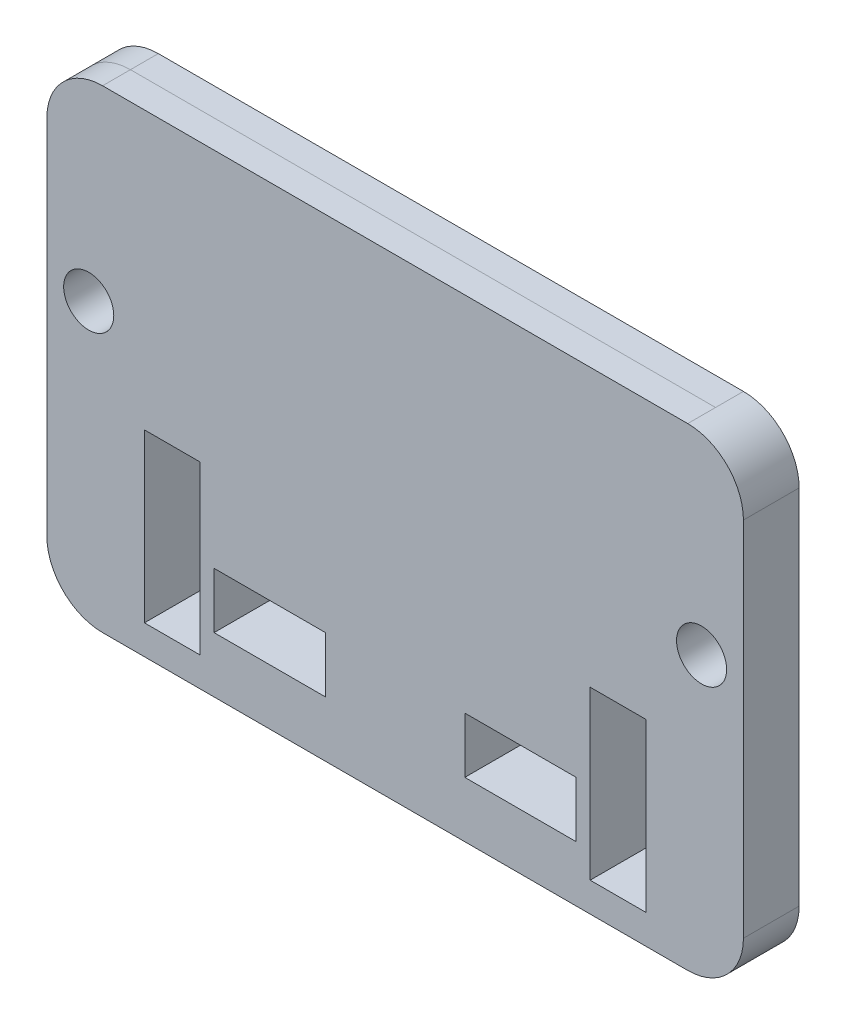
ISO-10303-21;
HEADER;
FILE_DESCRIPTION(('STEP AP214'),'2;1');
FILE_NAME('part.step','',(''),(''),'','','');
FILE_SCHEMA(('AUTOMOTIVE_DESIGN { 1 0 10303 214 1 1 1 1 }'));
ENDSEC;
DATA;
#1=APPLICATION_CONTEXT('core data for automotive mechanical design processes');
#2=APPLICATION_PROTOCOL_DEFINITION('international standard','automotive_design',2000,#1);
#3=PRODUCT_CONTEXT('',#1,'mechanical');
#4=PRODUCT('Part','Part','',(#3));
#5=PRODUCT_RELATED_PRODUCT_CATEGORY('part','',(#4));
#6=PRODUCT_DEFINITION_FORMATION('','',#4);
#7=PRODUCT_DEFINITION_CONTEXT('part definition',#1,'design');
#8=PRODUCT_DEFINITION('design','',#6,#7);
#9=PRODUCT_DEFINITION_SHAPE('','',#8);
#10=(LENGTH_UNIT() NAMED_UNIT(*) SI_UNIT(.MILLI.,.METRE.));
#11=(NAMED_UNIT(*) PLANE_ANGLE_UNIT() SI_UNIT($,.RADIAN.));
#12=(NAMED_UNIT(*) SI_UNIT($,.STERADIAN.) SOLID_ANGLE_UNIT());
#13=UNCERTAINTY_MEASURE_WITH_UNIT(LENGTH_MEASURE(1.E-05),#10,'distance_accuracy_value','');
#14=(GEOMETRIC_REPRESENTATION_CONTEXT(3) GLOBAL_UNCERTAINTY_ASSIGNED_CONTEXT((#13)) GLOBAL_UNIT_ASSIGNED_CONTEXT((#10,
#11,#12)) REPRESENTATION_CONTEXT('',''));
#15=CARTESIAN_POINT('',(0.,0.,0.));
#16=DIRECTION('',(0.,0.,1.));
#17=DIRECTION('',(1.,0.,0.));
#18=AXIS2_PLACEMENT_3D('',#15,#16,#17);
#19=CARTESIAN_POINT('',(-133.373251541,-107.95,25.4));
#20=DIRECTION('',(0.,1.,0.));
#21=DIRECTION('',(-1.,0.,0.));
#22=AXIS2_PLACEMENT_3D('',#19,#20,#21);
#23=PLANE('',#22);
#24=DIRECTION('',(0.,0.,-1.));
#25=VECTOR('',#24,1.);
#26=CARTESIAN_POINT('',(-133.373251541,-107.95,25.4));
#27=LINE('',#26,#25);
#28=CARTESIAN_POINT('',(-133.373251541,-107.95,25.4));
#29=VERTEX_POINT('',#28);
#30=CARTESIAN_POINT('',(-133.373251541,-107.95,12.7));
#31=VERTEX_POINT('',#30);
#32=EDGE_CURVE('E429',#29,#31,#27,.T.);
#33=ORIENTED_EDGE('',*,*,#32,.T.);
#34=DIRECTION('',(1.,0.,0.));
#35=VECTOR('',#34,1.);
#36=CARTESIAN_POINT('',(-133.373251541,-107.95,12.7));
#37=LINE('',#36,#35);
#38=CARTESIAN_POINT('',(133.373251541,-107.95,12.7));
#39=VERTEX_POINT('',#38);
#40=EDGE_CURVE('E12',#31,#39,#37,.T.);
#41=ORIENTED_EDGE('',*,*,#40,.T.);
#42=DIRECTION('',(0.,0.,-1.));
#43=VECTOR('',#42,1.);
#44=CARTESIAN_POINT('',(133.373251541,-107.95,25.4));
#45=LINE('',#44,#43);
#46=CARTESIAN_POINT('',(133.373251541,-107.95,25.4));
#47=VERTEX_POINT('',#46);
#48=EDGE_CURVE('E425',#47,#39,#45,.T.);
#49=ORIENTED_EDGE('',*,*,#48,.F.);
#50=DIRECTION('',(1.,0.,0.));
#51=VECTOR('',#50,1.);
#52=CARTESIAN_POINT('',(-133.373251541,-107.95,25.4));
#53=LINE('',#52,#51);
#54=EDGE_CURVE('E367',#29,#47,#53,.T.);
#55=ORIENTED_EDGE('',*,*,#54,.F.);
#56=EDGE_LOOP('',(#33,#41,#49,#55));
#57=FACE_BOUND('',#56,.T.);
#58=ADVANCED_FACE('F39',(#57),#23,.F.);
#59=CARTESIAN_POINT('',(-133.373251541,-82.55,25.4));
#60=DIRECTION('',(0.,0.,-1.));
#61=DIRECTION('',(-1.,0.,0.));
#62=AXIS2_PLACEMENT_3D('',#59,#60,#61);
#63=CYLINDRICAL_SURFACE('',#62,25.4);
#64=DIRECTION('',(0.,0.,-1.));
#65=VECTOR('',#64,1.);
#66=CARTESIAN_POINT('',(-158.773251541,-82.55,25.4));
#67=LINE('',#66,#65);
#68=CARTESIAN_POINT('',(-158.773251541,-82.55,25.4));
#69=VERTEX_POINT('',#68);
#70=CARTESIAN_POINT('',(-158.773251541,-82.55,12.7));
#71=VERTEX_POINT('',#70);
#72=EDGE_CURVE('E403',#69,#71,#67,.T.);
#73=ORIENTED_EDGE('',*,*,#72,.T.);
#74=CARTESIAN_POINT('',(-133.373251541,-82.55,12.7));
#75=DIRECTION('',(0.,0.,1.));
#76=DIRECTION('',(1.,0.,0.));
#77=AXIS2_PLACEMENT_3D('',#74,#75,#76);
#78=CIRCLE('',#77,25.4);
#79=EDGE_CURVE('E47',#71,#31,#78,.T.);
#80=ORIENTED_EDGE('',*,*,#79,.T.);
#81=ORIENTED_EDGE('',*,*,#32,.F.);
#82=CARTESIAN_POINT('',(-133.373251541,-82.55,25.4));
#83=DIRECTION('',(0.,0.,1.));
#84=DIRECTION('',(-1.,0.,0.));
#85=AXIS2_PLACEMENT_3D('',#82,#83,#84);
#86=CIRCLE('',#85,25.4);
#87=EDGE_CURVE('E364',#69,#29,#86,.T.);
#88=ORIENTED_EDGE('',*,*,#87,.F.);
#89=EDGE_LOOP('',(#73,#80,#81,#88));
#90=FACE_BOUND('',#89,.T.);
#91=ADVANCED_FACE('F443',(#90),#63,.T.);
#92=CARTESIAN_POINT('',(-158.773251541,-82.55,25.4));
#93=DIRECTION('',(1.,0.,0.));
#94=DIRECTION('',(0.,0.,-1.));
#95=AXIS2_PLACEMENT_3D('',#92,#93,#94);
#96=PLANE('',#95);
#97=DIRECTION('',(0.,0.,-1.));
#98=VECTOR('',#97,1.);
#99=CARTESIAN_POINT('',(-158.773251541,82.5499999999999,25.4));
#100=LINE('',#99,#98);
#101=CARTESIAN_POINT('',(-158.773251541,82.5499999999999,25.4));
#102=VERTEX_POINT('',#101);
#103=CARTESIAN_POINT('',(-158.773251541,82.5499999999999,12.7));
#104=VERTEX_POINT('',#103);
#105=EDGE_CURVE('E407',#102,#104,#100,.T.);
#106=ORIENTED_EDGE('',*,*,#105,.T.);
#107=DIRECTION('',(0.,-1.,0.));
#108=VECTOR('',#107,1.);
#109=CARTESIAN_POINT('',(-158.773251541,-82.55,12.7));
#110=LINE('',#109,#108);
#111=EDGE_CURVE('E437',#104,#71,#110,.T.);
#112=ORIENTED_EDGE('',*,*,#111,.T.);
#113=ORIENTED_EDGE('',*,*,#72,.F.);
#114=DIRECTION('',(0.,-1.,0.));
#115=VECTOR('',#114,1.);
#116=CARTESIAN_POINT('',(-158.773251541,-82.55,25.4));
#117=LINE('',#116,#115);
#118=EDGE_CURVE('E380',#102,#69,#117,.T.);
#119=ORIENTED_EDGE('',*,*,#118,.F.);
#120=EDGE_LOOP('',(#106,#112,#113,#119));
#121=FACE_BOUND('',#120,.T.);
#122=ADVANCED_FACE('F460',(#121),#96,.F.);
#123=CARTESIAN_POINT('',(-133.373251541,107.95,25.4));
#124=DIRECTION('',(0.,-1.,0.));
#125=DIRECTION('',(1.,0.,0.));
#126=AXIS2_PLACEMENT_3D('',#123,#124,#125);
#127=PLANE('',#126);
#128=DIRECTION('',(0.,0.,-1.));
#129=VECTOR('',#128,1.);
#130=CARTESIAN_POINT('',(133.373251541,107.95,25.4));
#131=LINE('',#130,#129);
#132=CARTESIAN_POINT('',(133.373251541,107.95,25.4));
#133=VERTEX_POINT('',#132);
#134=CARTESIAN_POINT('',(133.373251541,107.95,12.7));
#135=VERTEX_POINT('',#134);
#136=EDGE_CURVE('E415',#133,#135,#131,.T.);
#137=ORIENTED_EDGE('',*,*,#136,.T.);
#138=DIRECTION('',(-1.,0.,0.));
#139=VECTOR('',#138,1.);
#140=CARTESIAN_POINT('',(-133.373251541,107.95,12.7));
#141=LINE('',#140,#139);
#142=CARTESIAN_POINT('',(-133.373251541,107.95,12.7));
#143=VERTEX_POINT('',#142);
#144=EDGE_CURVE('E435',#135,#143,#141,.T.);
#145=ORIENTED_EDGE('',*,*,#144,.T.);
#146=DIRECTION('',(0.,0.,-1.));
#147=VECTOR('',#146,1.);
#148=CARTESIAN_POINT('',(-133.373251541,107.95,25.4));
#149=LINE('',#148,#147);
#150=CARTESIAN_POINT('',(-133.373251541,107.95,25.4));
#151=VERTEX_POINT('',#150);
#152=EDGE_CURVE('E411',#151,#143,#149,.T.);
#153=ORIENTED_EDGE('',*,*,#152,.F.);
#154=DIRECTION('',(-1.,0.,0.));
#155=VECTOR('',#154,1.);
#156=CARTESIAN_POINT('',(-133.373251541,107.95,25.4));
#157=LINE('',#156,#155);
#158=EDGE_CURVE('E376',#133,#151,#157,.T.);
#159=ORIENTED_EDGE('',*,*,#158,.F.);
#160=EDGE_LOOP('',(#137,#145,#153,#159));
#161=FACE_BOUND('',#160,.T.);
#162=ADVANCED_FACE('F489',(#161),#127,.F.);
#163=CARTESIAN_POINT('',(-133.373251541,82.5499999999999,25.4));
#164=DIRECTION('',(0.,0.,-1.));
#165=DIRECTION('',(-1.,0.,0.));
#166=AXIS2_PLACEMENT_3D('',#163,#164,#165);
#167=CYLINDRICAL_SURFACE('',#166,25.4);
#168=ORIENTED_EDGE('',*,*,#152,.T.);
#169=CARTESIAN_POINT('',(-133.373251541,82.5499999999999,12.7));
#170=DIRECTION('',(0.,0.,1.));
#171=DIRECTION('',(1.,0.,0.));
#172=AXIS2_PLACEMENT_3D('',#169,#170,#171);
#173=CIRCLE('',#172,25.4);
#174=EDGE_CURVE('E432',#143,#104,#173,.T.);
#175=ORIENTED_EDGE('',*,*,#174,.T.);
#176=ORIENTED_EDGE('',*,*,#105,.F.);
#177=CARTESIAN_POINT('',(-133.373251541,82.5499999999999,25.4));
#178=DIRECTION('',(0.,0.,1.));
#179=DIRECTION('',(-1.,0.,0.));
#180=AXIS2_PLACEMENT_3D('',#177,#178,#179);
#181=CIRCLE('',#180,25.4);
#182=EDGE_CURVE('E378',#151,#102,#181,.T.);
#183=ORIENTED_EDGE('',*,*,#182,.F.);
#184=EDGE_LOOP('',(#168,#175,#176,#183));
#185=FACE_BOUND('',#184,.T.);
#186=ADVANCED_FACE('F492',(#185),#167,.T.);
#187=CARTESIAN_POINT('',(-133.373251541,-82.55,25.4));
#188=DIRECTION('',(0.,0.,-1.));
#189=DIRECTION('',(-1.,0.,0.));
#190=AXIS2_PLACEMENT_3D('',#187,#188,#189);
#191=PLANE('',#190);
#192=DIRECTION('',(0.,-1.,0.));
#193=VECTOR('',#192,1.);
#194=CARTESIAN_POINT('',(-88.9,-94.5600768180002,25.4));
#195=LINE('',#194,#193);
#196=CARTESIAN_POINT('',(-88.9,-18.3600768180002,25.4));
#197=VERTEX_POINT('',#196);
#198=CARTESIAN_POINT('',(-88.9,-94.5600768180002,25.4));
#199=VERTEX_POINT('',#198);
#200=EDGE_CURVE('E229',#197,#199,#195,.T.);
#201=ORIENTED_EDGE('',*,*,#200,.T.);
#202=DIRECTION('',(-1.,0.,0.));
#203=VECTOR('',#202,1.);
#204=CARTESIAN_POINT('',(-114.3,-94.5600768180002,25.4));
#205=LINE('',#204,#203);
#206=CARTESIAN_POINT('',(-114.3,-94.5600768180002,25.4));
#207=VERTEX_POINT('',#206);
#208=EDGE_CURVE('E221',#199,#207,#205,.T.);
#209=ORIENTED_EDGE('',*,*,#208,.T.);
#210=DIRECTION('',(0.,1.,0.));
#211=VECTOR('',#210,1.);
#212=CARTESIAN_POINT('',(-114.3,-18.3600768180002,25.4));
#213=LINE('',#212,#211);
#214=CARTESIAN_POINT('',(-114.3,-18.3600768180002,25.4));
#215=VERTEX_POINT('',#214);
#216=EDGE_CURVE('E232',#207,#215,#213,.T.);
#217=ORIENTED_EDGE('',*,*,#216,.T.);
#218=DIRECTION('',(1.,0.,0.));
#219=VECTOR('',#218,1.);
#220=CARTESIAN_POINT('',(-88.9,-18.3600768180002,25.4));
#221=LINE('',#220,#219);
#222=EDGE_CURVE('E54',#215,#197,#221,.T.);
#223=ORIENTED_EDGE('',*,*,#222,.T.);
#224=EDGE_LOOP('',(#201,#209,#217,#223));
#225=FACE_BOUND('',#224,.T.);
#226=DIRECTION('',(0.,-1.,0.));
#227=VECTOR('',#226,1.);
#228=CARTESIAN_POINT('',(114.3,-94.5600768180004,25.4));
#229=LINE('',#228,#227);
#230=CARTESIAN_POINT('',(114.3,-18.3600768180004,25.4));
#231=VERTEX_POINT('',#230);
#232=CARTESIAN_POINT('',(114.3,-94.5600768180004,25.4));
#233=VERTEX_POINT('',#232);
#234=EDGE_CURVE('E262',#231,#233,#229,.T.);
#235=ORIENTED_EDGE('',*,*,#234,.T.);
#236=DIRECTION('',(-1.,0.,0.));
#237=VECTOR('',#236,1.);
#238=CARTESIAN_POINT('',(88.9,-94.5600768180004,25.4));
#239=LINE('',#238,#237);
#240=CARTESIAN_POINT('',(88.9,-94.5600768180004,25.4));
#241=VERTEX_POINT('',#240);
#242=EDGE_CURVE('E273',#233,#241,#239,.T.);
#243=ORIENTED_EDGE('',*,*,#242,.T.);
#244=DIRECTION('',(0.,1.,0.));
#245=VECTOR('',#244,1.);
#246=CARTESIAN_POINT('',(88.9,-18.3600768180004,25.4));
#247=LINE('',#246,#245);
#248=CARTESIAN_POINT('',(88.9,-18.3600768180004,25.4));
#249=VERTEX_POINT('',#248);
#250=EDGE_CURVE('E283',#241,#249,#247,.T.);
#251=ORIENTED_EDGE('',*,*,#250,.T.);
#252=DIRECTION('',(1.,0.,0.));
#253=VECTOR('',#252,1.);
#254=CARTESIAN_POINT('',(114.3,-18.3600768180004,25.4));
#255=LINE('',#254,#253);
#256=EDGE_CURVE('E62',#249,#231,#255,.T.);
#257=ORIENTED_EDGE('',*,*,#256,.T.);
#258=EDGE_LOOP('',(#235,#243,#251,#257));
#259=FACE_BOUND('',#258,.T.);
#260=DIRECTION('',(-1.,0.,0.));
#261=VECTOR('',#260,1.);
#262=CARTESIAN_POINT('',(82.55,-82.55,25.4));
#263=LINE('',#262,#261);
#264=CARTESIAN_POINT('',(82.55,-82.55,25.4));
#265=VERTEX_POINT('',#264);
#266=CARTESIAN_POINT('',(31.75,-82.55,25.4));
#267=VERTEX_POINT('',#266);
#268=EDGE_CURVE('E298',#265,#267,#263,.T.);
#269=ORIENTED_EDGE('',*,*,#268,.T.);
#270=DIRECTION('',(0.,1.,0.));
#271=VECTOR('',#270,1.);
#272=CARTESIAN_POINT('',(31.75,-82.55,25.4));
#273=LINE('',#272,#271);
#274=CARTESIAN_POINT('',(31.75,-57.15,25.4));
#275=VERTEX_POINT('',#274);
#276=EDGE_CURVE('E288',#267,#275,#273,.T.);
#277=ORIENTED_EDGE('',*,*,#276,.T.);
#278=DIRECTION('',(1.,0.,0.));
#279=VECTOR('',#278,1.);
#280=CARTESIAN_POINT('',(82.55,-57.15,25.4));
#281=LINE('',#280,#279);
#282=CARTESIAN_POINT('',(82.55,-57.15,25.4));
#283=VERTEX_POINT('',#282);
#284=EDGE_CURVE('E291',#275,#283,#281,.T.);
#285=ORIENTED_EDGE('',*,*,#284,.T.);
#286=DIRECTION('',(0.,-1.,0.));
#287=VECTOR('',#286,1.);
#288=CARTESIAN_POINT('',(82.55,-82.55,25.4));
#289=LINE('',#288,#287);
#290=EDGE_CURVE('E295',#283,#265,#289,.T.);
#291=ORIENTED_EDGE('',*,*,#290,.T.);
#292=EDGE_LOOP('',(#269,#277,#285,#291));
#293=FACE_BOUND('',#292,.T.);
#294=DIRECTION('',(-1.,0.,0.));
#295=VECTOR('',#294,1.);
#296=CARTESIAN_POINT('',(-31.75,-82.55,25.4));
#297=LINE('',#296,#295);
#298=CARTESIAN_POINT('',(-31.75,-82.55,25.4));
#299=VERTEX_POINT('',#298);
#300=CARTESIAN_POINT('',(-82.55,-82.55,25.4));
#301=VERTEX_POINT('',#300);
#302=EDGE_CURVE('E325',#299,#301,#297,.T.);
#303=ORIENTED_EDGE('',*,*,#302,.T.);
#304=DIRECTION('',(0.,1.,0.));
#305=VECTOR('',#304,1.);
#306=CARTESIAN_POINT('',(-82.55,-82.55,25.4));
#307=LINE('',#306,#305);
#308=CARTESIAN_POINT('',(-82.55,-57.15,25.4));
#309=VERTEX_POINT('',#308);
#310=EDGE_CURVE('E335',#301,#309,#307,.T.);
#311=ORIENTED_EDGE('',*,*,#310,.T.);
#312=DIRECTION('',(1.,0.,0.));
#313=VECTOR('',#312,1.);
#314=CARTESIAN_POINT('',(-31.75,-57.15,25.4));
#315=LINE('',#314,#313);
#316=CARTESIAN_POINT('',(-31.75,-57.15,25.4));
#317=VERTEX_POINT('',#316);
#318=EDGE_CURVE('E347',#309,#317,#315,.T.);
#319=ORIENTED_EDGE('',*,*,#318,.T.);
#320=DIRECTION('',(0.,-1.,0.));
#321=VECTOR('',#320,1.);
#322=CARTESIAN_POINT('',(-31.75,-82.55,25.4));
#323=LINE('',#322,#321);
#324=EDGE_CURVE('E344',#317,#299,#323,.T.);
#325=ORIENTED_EDGE('',*,*,#324,.T.);
#326=EDGE_LOOP('',(#303,#311,#319,#325));
#327=FACE_BOUND('',#326,.T.);
#328=ORIENTED_EDGE('',*,*,#87,.T.);
#329=ORIENTED_EDGE('',*,*,#54,.T.);
#330=CARTESIAN_POINT('',(133.373251541,-82.55,25.4));
#331=DIRECTION('',(0.,0.,1.));
#332=DIRECTION('',(1.,0.,0.));
#333=AXIS2_PLACEMENT_3D('',#330,#331,#332);
#334=CIRCLE('',#333,25.4);
#335=CARTESIAN_POINT('',(158.773251541,-82.55,25.4));
#336=VERTEX_POINT('',#335);
#337=EDGE_CURVE('E370',#47,#336,#334,.T.);
#338=ORIENTED_EDGE('',*,*,#337,.T.);
#339=DIRECTION('',(0.,1.,0.));
#340=VECTOR('',#339,1.);
#341=CARTESIAN_POINT('',(158.773251541,-82.55,25.4));
#342=LINE('',#341,#340);
#343=CARTESIAN_POINT('',(158.773251541,82.55,25.4));
#344=VERTEX_POINT('',#343);
#345=EDGE_CURVE('E372',#336,#344,#342,.T.);
#346=ORIENTED_EDGE('',*,*,#345,.T.);
#347=CARTESIAN_POINT('',(133.373251541,82.55,25.4));
#348=DIRECTION('',(0.,0.,1.));
#349=DIRECTION('',(-1.,0.,0.));
#350=AXIS2_PLACEMENT_3D('',#347,#348,#349);
#351=CIRCLE('',#350,25.4);
#352=EDGE_CURVE('E374',#344,#133,#351,.T.);
#353=ORIENTED_EDGE('',*,*,#352,.T.);
#354=ORIENTED_EDGE('',*,*,#158,.T.);
#355=ORIENTED_EDGE('',*,*,#182,.T.);
#356=ORIENTED_EDGE('',*,*,#118,.T.);
#357=EDGE_LOOP('',(#328,#329,#338,#346,#353,#354,#355,#356));
#358=FACE_BOUND('',#357,.T.);
#359=CARTESIAN_POINT('',(-139.7,19.739923182,25.4));
#360=DIRECTION('',(0.,0.,1.));
#361=DIRECTION('',(1.,0.,0.));
#362=AXIS2_PLACEMENT_3D('',#359,#360,#361);
#363=CIRCLE('',#362,11.422);
#364=CARTESIAN_POINT('',(-128.278,19.739923182,25.4));
#365=VERTEX_POINT('',#364);
#366=EDGE_CURVE('E358',#365,#365,#363,.T.);
#367=ORIENTED_EDGE('',*,*,#366,.F.);
#368=EDGE_LOOP('',(#367));
#369=FACE_BOUND('',#368,.T.);
#370=CARTESIAN_POINT('',(139.7,19.739923182,25.4));
#371=DIRECTION('',(0.,0.,1.));
#372=DIRECTION('',(1.,0.,0.));
#373=AXIS2_PLACEMENT_3D('',#370,#371,#372);
#374=CIRCLE('',#373,11.422);
#375=CARTESIAN_POINT('',(151.122,19.739923182,25.4));
#376=VERTEX_POINT('',#375);
#377=EDGE_CURVE('E352',#376,#376,#374,.T.);
#378=ORIENTED_EDGE('',*,*,#377,.F.);
#379=EDGE_LOOP('',(#378));
#380=FACE_BOUND('',#379,.T.);
#381=ADVANCED_FACE('F236',(#225,#259,#293,#327,#358,#369,#380),#191,.F.);
#382=CARTESIAN_POINT('',(-133.373251541,-82.55,0.));
#383=DIRECTION('',(0.,0.,-1.));
#384=DIRECTION('',(-1.,0.,0.));
#385=AXIS2_PLACEMENT_3D('',#382,#383,#384);
#386=PLANE('',#385);
#387=DIRECTION('',(-1.,0.,0.));
#388=VECTOR('',#387,1.);
#389=CARTESIAN_POINT('',(-114.3,-94.5600768180002,0.));
#390=LINE('',#389,#388);
#391=CARTESIAN_POINT('',(-88.9,-94.5600768180002,0.));
#392=VERTEX_POINT('',#391);
#393=CARTESIAN_POINT('',(-114.3,-94.5600768180002,0.));
#394=VERTEX_POINT('',#393);
#395=EDGE_CURVE('E224',#392,#394,#390,.T.);
#396=ORIENTED_EDGE('',*,*,#395,.F.);
#397=DIRECTION('',(0.,-1.,0.));
#398=VECTOR('',#397,1.);
#399=CARTESIAN_POINT('',(-88.9,-94.5600768180002,0.));
#400=LINE('',#399,#398);
#401=CARTESIAN_POINT('',(-88.9,-18.3600768180002,0.));
#402=VERTEX_POINT('',#401);
#403=EDGE_CURVE('E239',#402,#392,#400,.T.);
#404=ORIENTED_EDGE('',*,*,#403,.F.);
#405=DIRECTION('',(1.,0.,0.));
#406=VECTOR('',#405,1.);
#407=CARTESIAN_POINT('',(-88.9,-18.3600768180002,0.));
#408=LINE('',#407,#406);
#409=CARTESIAN_POINT('',(-114.3,-18.3600768180002,0.));
#410=VERTEX_POINT('',#409);
#411=EDGE_CURVE('E242',#410,#402,#408,.T.);
#412=ORIENTED_EDGE('',*,*,#411,.F.);
#413=DIRECTION('',(0.,1.,0.));
#414=VECTOR('',#413,1.);
#415=CARTESIAN_POINT('',(-114.3,-18.3600768180002,0.));
#416=LINE('',#415,#414);
#417=EDGE_CURVE('E248',#394,#410,#416,.T.);
#418=ORIENTED_EDGE('',*,*,#417,.F.);
#419=EDGE_LOOP('',(#396,#404,#412,#418));
#420=FACE_BOUND('',#419,.T.);
#421=DIRECTION('',(-1.,0.,0.));
#422=VECTOR('',#421,1.);
#423=CARTESIAN_POINT('',(88.9,-94.5600768180004,0.));
#424=LINE('',#423,#422);
#425=CARTESIAN_POINT('',(114.3,-94.5600768180004,0.));
#426=VERTEX_POINT('',#425);
#427=CARTESIAN_POINT('',(88.9,-94.5600768180004,0.));
#428=VERTEX_POINT('',#427);
#429=EDGE_CURVE('E249',#426,#428,#424,.T.);
#430=ORIENTED_EDGE('',*,*,#429,.F.);
#431=DIRECTION('',(0.,-1.,0.));
#432=VECTOR('',#431,1.);
#433=CARTESIAN_POINT('',(114.3,-94.5600768180004,0.));
#434=LINE('',#433,#432);
#435=CARTESIAN_POINT('',(114.3,-18.3600768180004,0.));
#436=VERTEX_POINT('',#435);
#437=EDGE_CURVE('E269',#436,#426,#434,.T.);
#438=ORIENTED_EDGE('',*,*,#437,.F.);
#439=DIRECTION('',(1.,0.,0.));
#440=VECTOR('',#439,1.);
#441=CARTESIAN_POINT('',(114.3,-18.3600768180004,0.));
#442=LINE('',#441,#440);
#443=CARTESIAN_POINT('',(88.9,-18.3600768180004,0.));
#444=VERTEX_POINT('',#443);
#445=EDGE_CURVE('E272',#444,#436,#442,.T.);
#446=ORIENTED_EDGE('',*,*,#445,.F.);
#447=DIRECTION('',(0.,1.,0.));
#448=VECTOR('',#447,1.);
#449=CARTESIAN_POINT('',(88.9,-18.3600768180004,0.));
#450=LINE('',#449,#448);
#451=EDGE_CURVE('E276',#428,#444,#450,.T.);
#452=ORIENTED_EDGE('',*,*,#451,.F.);
#453=EDGE_LOOP('',(#430,#438,#446,#452));
#454=FACE_BOUND('',#453,.T.);
#455=DIRECTION('',(0.,1.,0.));
#456=VECTOR('',#455,1.);
#457=CARTESIAN_POINT('',(31.75,-82.55,0.));
#458=LINE('',#457,#456);
#459=CARTESIAN_POINT('',(31.75,-82.55,0.));
#460=VERTEX_POINT('',#459);
#461=CARTESIAN_POINT('',(31.75,-57.15,0.));
#462=VERTEX_POINT('',#461);
#463=EDGE_CURVE('E302',#460,#462,#458,.T.);
#464=ORIENTED_EDGE('',*,*,#463,.F.);
#465=DIRECTION('',(-1.,0.,0.));
#466=VECTOR('',#465,1.);
#467=CARTESIAN_POINT('',(82.55,-82.55,0.));
#468=LINE('',#467,#466);
#469=CARTESIAN_POINT('',(82.55,-82.55,0.));
#470=VERTEX_POINT('',#469);
#471=EDGE_CURVE('E292',#470,#460,#468,.T.);
#472=ORIENTED_EDGE('',*,*,#471,.F.);
#473=DIRECTION('',(0.,-1.,0.));
#474=VECTOR('',#473,1.);
#475=CARTESIAN_POINT('',(82.55,-82.55,0.));
#476=LINE('',#475,#474);
#477=CARTESIAN_POINT('',(82.55,-57.15,0.));
#478=VERTEX_POINT('',#477);
#479=EDGE_CURVE('E308',#478,#470,#476,.T.);
#480=ORIENTED_EDGE('',*,*,#479,.F.);
#481=DIRECTION('',(1.,0.,0.));
#482=VECTOR('',#481,1.);
#483=CARTESIAN_POINT('',(82.55,-57.15,0.));
#484=LINE('',#483,#482);
#485=EDGE_CURVE('E304',#462,#478,#484,.T.);
#486=ORIENTED_EDGE('',*,*,#485,.F.);
#487=EDGE_LOOP('',(#464,#472,#480,#486));
#488=FACE_BOUND('',#487,.T.);
#489=DIRECTION('',(0.,1.,0.));
#490=VECTOR('',#489,1.);
#491=CARTESIAN_POINT('',(-82.55,-82.55,0.));
#492=LINE('',#491,#490);
#493=CARTESIAN_POINT('',(-82.55,-82.55,0.));
#494=VERTEX_POINT('',#493);
#495=CARTESIAN_POINT('',(-82.55,-57.15,0.));
#496=VERTEX_POINT('',#495);
#497=EDGE_CURVE('E305',#494,#496,#492,.T.);
#498=ORIENTED_EDGE('',*,*,#497,.F.);
#499=DIRECTION('',(-1.,0.,0.));
#500=VECTOR('',#499,1.);
#501=CARTESIAN_POINT('',(-31.75,-82.55,0.));
#502=LINE('',#501,#500);
#503=CARTESIAN_POINT('',(-31.75,-82.55,0.));
#504=VERTEX_POINT('',#503);
#505=EDGE_CURVE('E331',#504,#494,#502,.T.);
#506=ORIENTED_EDGE('',*,*,#505,.F.);
#507=DIRECTION('',(0.,-1.,0.));
#508=VECTOR('',#507,1.);
#509=CARTESIAN_POINT('',(-31.75,-82.55,0.));
#510=LINE('',#509,#508);
#511=CARTESIAN_POINT('',(-31.75,-57.15,0.));
#512=VERTEX_POINT('',#511);
#513=EDGE_CURVE('E334',#512,#504,#510,.T.);
#514=ORIENTED_EDGE('',*,*,#513,.F.);
#515=DIRECTION('',(1.,0.,0.));
#516=VECTOR('',#515,1.);
#517=CARTESIAN_POINT('',(-31.75,-57.15,0.));
#518=LINE('',#517,#516);
#519=EDGE_CURVE('E338',#496,#512,#518,.T.);
#520=ORIENTED_EDGE('',*,*,#519,.F.);
#521=EDGE_LOOP('',(#498,#506,#514,#520));
#522=FACE_BOUND('',#521,.T.);
#523=CARTESIAN_POINT('',(-139.7,19.739923182,0.));
#524=DIRECTION('',(0.,0.,1.));
#525=DIRECTION('',(1.,0.,0.));
#526=AXIS2_PLACEMENT_3D('',#523,#524,#525);
#527=CIRCLE('',#526,11.422);
#528=CARTESIAN_POINT('',(-128.278,19.739923182,0.));
#529=VERTEX_POINT('',#528);
#530=EDGE_CURVE('E355',#529,#529,#527,.T.);
#531=ORIENTED_EDGE('',*,*,#530,.T.);
#532=EDGE_LOOP('',(#531));
#533=FACE_BOUND('',#532,.T.);
#534=CARTESIAN_POINT('',(-133.373251541,-82.55,0.));
#535=DIRECTION('',(0.,0.,1.));
#536=DIRECTION('',(-1.,0.,0.));
#537=AXIS2_PLACEMENT_3D('',#534,#535,#536);
#538=CIRCLE('',#537,25.4);
#539=CARTESIAN_POINT('',(-158.773251541,-82.55,0.));
#540=VERTEX_POINT('',#539);
#541=CARTESIAN_POINT('',(-133.373251541,-107.95,0.));
#542=VERTEX_POINT('',#541);
#543=EDGE_CURVE('E361',#540,#542,#538,.T.);
#544=ORIENTED_EDGE('',*,*,#543,.F.);
#545=DIRECTION('',(0.,-1.,0.));
#546=VECTOR('',#545,1.);
#547=CARTESIAN_POINT('',(-158.773251541,-82.55,0.));
#548=LINE('',#547,#546);
#549=CARTESIAN_POINT('',(-158.773251541,82.5499999999999,0.));
#550=VERTEX_POINT('',#549);
#551=EDGE_CURVE('E368',#550,#540,#548,.T.);
#552=ORIENTED_EDGE('',*,*,#551,.F.);
#553=CARTESIAN_POINT('',(-133.373251541,82.5499999999999,0.));
#554=DIRECTION('',(0.,0.,1.));
#555=DIRECTION('',(-1.,0.,0.));
#556=AXIS2_PLACEMENT_3D('',#553,#554,#555);
#557=CIRCLE('',#556,25.4);
#558=CARTESIAN_POINT('',(-133.373251541,107.95,0.));
#559=VERTEX_POINT('',#558);
#560=EDGE_CURVE('E398',#559,#550,#557,.T.);
#561=ORIENTED_EDGE('',*,*,#560,.F.);
#562=DIRECTION('',(-1.,0.,0.));
#563=VECTOR('',#562,1.);
#564=CARTESIAN_POINT('',(-133.373251541,107.95,0.));
#565=LINE('',#564,#563);
#566=CARTESIAN_POINT('',(133.373251541,107.95,0.));
#567=VERTEX_POINT('',#566);
#568=EDGE_CURVE('E395',#567,#559,#565,.T.);
#569=ORIENTED_EDGE('',*,*,#568,.F.);
#570=CARTESIAN_POINT('',(133.373251541,82.55,0.));
#571=DIRECTION('',(0.,0.,1.));
#572=DIRECTION('',(-1.,0.,0.));
#573=AXIS2_PLACEMENT_3D('',#570,#571,#572);
#574=CIRCLE('',#573,25.4);
#575=CARTESIAN_POINT('',(158.773251541,82.55,0.));
#576=VERTEX_POINT('',#575);
#577=EDGE_CURVE('E392',#576,#567,#574,.T.);
#578=ORIENTED_EDGE('',*,*,#577,.F.);
#579=DIRECTION('',(0.,1.,0.));
#580=VECTOR('',#579,1.);
#581=CARTESIAN_POINT('',(158.773251541,-82.55,0.));
#582=LINE('',#581,#580);
#583=CARTESIAN_POINT('',(158.773251541,-82.55,0.));
#584=VERTEX_POINT('',#583);
#585=EDGE_CURVE('E390',#584,#576,#582,.T.);
#586=ORIENTED_EDGE('',*,*,#585,.F.);
#587=CARTESIAN_POINT('',(133.373251541,-82.55,0.));
#588=DIRECTION('',(0.,0.,1.));
#589=DIRECTION('',(1.,0.,0.));
#590=AXIS2_PLACEMENT_3D('',#587,#588,#589);
#591=CIRCLE('',#590,25.4);
#592=CARTESIAN_POINT('',(133.373251541,-107.95,0.));
#593=VERTEX_POINT('',#592);
#594=EDGE_CURVE('E388',#593,#584,#591,.T.);
#595=ORIENTED_EDGE('',*,*,#594,.F.);
#596=DIRECTION('',(1.,0.,0.));
#597=VECTOR('',#596,1.);
#598=CARTESIAN_POINT('',(-133.373251541,-107.95,0.));
#599=LINE('',#598,#597);
#600=EDGE_CURVE('E385',#542,#593,#599,.T.);
#601=ORIENTED_EDGE('',*,*,#600,.F.);
#602=EDGE_LOOP('',(#544,#552,#561,#569,#578,#586,#595,#601));
#603=FACE_BOUND('',#602,.T.);
#604=CARTESIAN_POINT('',(139.7,19.739923182,0.));
#605=DIRECTION('',(0.,0.,1.));
#606=DIRECTION('',(1.,0.,0.));
#607=AXIS2_PLACEMENT_3D('',#604,#605,#606);
#608=CIRCLE('',#607,11.422);
#609=CARTESIAN_POINT('',(151.122,19.739923182,0.));
#610=VERTEX_POINT('',#609);
#611=EDGE_CURVE('E315',#610,#610,#608,.T.);
#612=ORIENTED_EDGE('',*,*,#611,.T.);
#613=EDGE_LOOP('',(#612));
#614=FACE_BOUND('',#613,.T.);
#615=ADVANCED_FACE('F468',(#420,#454,#488,#522,#533,#603,#614),#386,.T.);
#616=ORIENTED_EDGE('',*,*,#79,.F.);
#617=EDGE_CURVE('E382',#71,#540,#67,.T.);
#618=ORIENTED_EDGE('',*,*,#617,.T.);
#619=ORIENTED_EDGE('',*,*,#543,.T.);
#620=EDGE_CURVE('E428',#31,#542,#27,.T.);
#621=ORIENTED_EDGE('',*,*,#620,.F.);
#622=EDGE_LOOP('',(#616,#618,#619,#621));
#623=FACE_BOUND('',#622,.T.);
#624=ADVANCED_FACE('F41',(#623),#63,.T.);
#625=ORIENTED_EDGE('',*,*,#40,.F.);
#626=ORIENTED_EDGE('',*,*,#620,.T.);
#627=ORIENTED_EDGE('',*,*,#600,.T.);
#628=EDGE_CURVE('E424',#39,#593,#45,.T.);
#629=ORIENTED_EDGE('',*,*,#628,.F.);
#630=EDGE_LOOP('',(#625,#626,#627,#629));
#631=FACE_BOUND('',#630,.T.);
#632=ADVANCED_FACE('F472',(#631),#23,.F.);
#633=CARTESIAN_POINT('',(133.373251541,-82.55,25.4));
#634=DIRECTION('',(0.,0.,-1.));
#635=DIRECTION('',(-1.,0.,0.));
#636=AXIS2_PLACEMENT_3D('',#633,#634,#635);
#637=CYLINDRICAL_SURFACE('',#636,25.4);
#638=ORIENTED_EDGE('',*,*,#594,.T.);
#639=DIRECTION('',(0.,0.,-1.));
#640=VECTOR('',#639,1.);
#641=CARTESIAN_POINT('',(158.773251541,-82.55,25.4));
#642=LINE('',#641,#640);
#643=EDGE_CURVE('E421',#336,#584,#642,.T.);
#644=ORIENTED_EDGE('',*,*,#643,.F.);
#645=ORIENTED_EDGE('',*,*,#337,.F.);
#646=ORIENTED_EDGE('',*,*,#48,.T.);
#647=ORIENTED_EDGE('',*,*,#628,.T.);
#648=EDGE_LOOP('',(#638,#644,#645,#646,#647));
#649=FACE_BOUND('',#648,.T.);
#650=ADVANCED_FACE('F474',(#649),#637,.T.);
#651=CARTESIAN_POINT('',(158.773251541,-82.55,25.4));
#652=DIRECTION('',(-1.,0.,0.));
#653=DIRECTION('',(0.,0.,1.));
#654=AXIS2_PLACEMENT_3D('',#651,#652,#653);
#655=PLANE('',#654);
#656=ORIENTED_EDGE('',*,*,#585,.T.);
#657=DIRECTION('',(0.,0.,-1.));
#658=VECTOR('',#657,1.);
#659=CARTESIAN_POINT('',(158.773251541,82.55,25.4));
#660=LINE('',#659,#658);
#661=EDGE_CURVE('E418',#344,#576,#660,.T.);
#662=ORIENTED_EDGE('',*,*,#661,.F.);
#663=ORIENTED_EDGE('',*,*,#345,.F.);
#664=ORIENTED_EDGE('',*,*,#643,.T.);
#665=EDGE_LOOP('',(#656,#662,#663,#664));
#666=FACE_BOUND('',#665,.T.);
#667=ADVANCED_FACE('F481',(#666),#655,.F.);
#668=CARTESIAN_POINT('',(133.373251541,82.55,25.4));
#669=DIRECTION('',(0.,0.,-1.));
#670=DIRECTION('',(-1.,0.,0.));
#671=AXIS2_PLACEMENT_3D('',#668,#669,#670);
#672=CYLINDRICAL_SURFACE('',#671,25.4);
#673=ORIENTED_EDGE('',*,*,#577,.T.);
#674=EDGE_CURVE('E414',#135,#567,#131,.T.);
#675=ORIENTED_EDGE('',*,*,#674,.F.);
#676=ORIENTED_EDGE('',*,*,#136,.F.);
#677=ORIENTED_EDGE('',*,*,#352,.F.);
#678=ORIENTED_EDGE('',*,*,#661,.T.);
#679=EDGE_LOOP('',(#673,#675,#676,#677,#678));
#680=FACE_BOUND('',#679,.T.);
#681=ADVANCED_FACE('F484',(#680),#672,.T.);
#682=ORIENTED_EDGE('',*,*,#144,.F.);
#683=ORIENTED_EDGE('',*,*,#674,.T.);
#684=ORIENTED_EDGE('',*,*,#568,.T.);
#685=EDGE_CURVE('E410',#143,#559,#149,.T.);
#686=ORIENTED_EDGE('',*,*,#685,.F.);
#687=EDGE_LOOP('',(#682,#683,#684,#686));
#688=FACE_BOUND('',#687,.T.);
#689=ADVANCED_FACE('F498',(#688),#127,.F.);
#690=ORIENTED_EDGE('',*,*,#174,.F.);
#691=ORIENTED_EDGE('',*,*,#685,.T.);
#692=ORIENTED_EDGE('',*,*,#560,.T.);
#693=EDGE_CURVE('E406',#104,#550,#100,.T.);
#694=ORIENTED_EDGE('',*,*,#693,.F.);
#695=EDGE_LOOP('',(#690,#691,#692,#694));
#696=FACE_BOUND('',#695,.T.);
#697=ADVANCED_FACE('F495',(#696),#167,.T.);
#698=ORIENTED_EDGE('',*,*,#111,.F.);
#699=ORIENTED_EDGE('',*,*,#693,.T.);
#700=ORIENTED_EDGE('',*,*,#551,.T.);
#701=ORIENTED_EDGE('',*,*,#617,.F.);
#702=EDGE_LOOP('',(#698,#699,#700,#701));
#703=FACE_BOUND('',#702,.T.);
#704=ADVANCED_FACE('F463',(#703),#96,.F.);
#705=CARTESIAN_POINT('',(-139.7,19.739923182,25.4));
#706=DIRECTION('',(0.,0.,-1.));
#707=DIRECTION('',(-1.,0.,0.));
#708=AXIS2_PLACEMENT_3D('',#705,#706,#707);
#709=CYLINDRICAL_SURFACE('',#708,11.422);
#710=ORIENTED_EDGE('',*,*,#366,.T.);
#711=EDGE_LOOP('',(#710));
#712=FACE_BOUND('',#711,.T.);
#713=ORIENTED_EDGE('',*,*,#530,.F.);
#714=EDGE_LOOP('',(#713));
#715=FACE_BOUND('',#714,.T.);
#716=ADVANCED_FACE('F534',(#712,#715),#709,.F.);
#717=CARTESIAN_POINT('',(139.7,19.739923182,25.4));
#718=DIRECTION('',(0.,0.,-1.));
#719=DIRECTION('',(-1.,0.,0.));
#720=AXIS2_PLACEMENT_3D('',#717,#718,#719);
#721=CYLINDRICAL_SURFACE('',#720,11.422);
#722=ORIENTED_EDGE('',*,*,#377,.T.);
#723=EDGE_LOOP('',(#722));
#724=FACE_BOUND('',#723,.T.);
#725=ORIENTED_EDGE('',*,*,#611,.F.);
#726=EDGE_LOOP('',(#725));
#727=FACE_BOUND('',#726,.T.);
#728=ADVANCED_FACE('F538',(#724,#727),#721,.F.);
#729=CARTESIAN_POINT('',(-82.55,-82.55,25.4));
#730=DIRECTION('',(-1.,0.,0.));
#731=DIRECTION('',(0.,0.,1.));
#732=AXIS2_PLACEMENT_3D('',#729,#730,#731);
#733=PLANE('',#732);
#734=ORIENTED_EDGE('',*,*,#497,.T.);
#735=DIRECTION('',(0.,0.,-1.));
#736=VECTOR('',#735,1.);
#737=CARTESIAN_POINT('',(-82.55,-57.15,25.4));
#738=LINE('',#737,#736);
#739=EDGE_CURVE('E322',#309,#496,#738,.T.);
#740=ORIENTED_EDGE('',*,*,#739,.F.);
#741=ORIENTED_EDGE('',*,*,#310,.F.);
#742=DIRECTION('',(0.,0.,-1.));
#743=VECTOR('',#742,1.);
#744=CARTESIAN_POINT('',(-82.55,-82.55,25.4));
#745=LINE('',#744,#743);
#746=EDGE_CURVE('E255',#301,#494,#745,.T.);
#747=ORIENTED_EDGE('',*,*,#746,.T.);
#748=EDGE_LOOP('',(#734,#740,#741,#747));
#749=FACE_BOUND('',#748,.T.);
#750=ADVANCED_FACE('F677',(#749),#733,.F.);
#751=CARTESIAN_POINT('',(-31.75,-82.55,25.4));
#752=DIRECTION('',(0.,-1.,0.));
#753=DIRECTION('',(0.,0.,-1.));
#754=AXIS2_PLACEMENT_3D('',#751,#752,#753);
#755=PLANE('',#754);
#756=ORIENTED_EDGE('',*,*,#505,.T.);
#757=ORIENTED_EDGE('',*,*,#746,.F.);
#758=ORIENTED_EDGE('',*,*,#302,.F.);
#759=DIRECTION('',(0.,0.,-1.));
#760=VECTOR('',#759,1.);
#761=CARTESIAN_POINT('',(-31.75,-82.55,25.4));
#762=LINE('',#761,#760);
#763=EDGE_CURVE('E328',#299,#504,#762,.T.);
#764=ORIENTED_EDGE('',*,*,#763,.T.);
#765=EDGE_LOOP('',(#756,#757,#758,#764));
#766=FACE_BOUND('',#765,.T.);
#767=ADVANCED_FACE('F680',(#766),#755,.F.);
#768=CARTESIAN_POINT('',(-31.75,-82.55,25.4));
#769=DIRECTION('',(1.,0.,0.));
#770=DIRECTION('',(0.,0.,-1.));
#771=AXIS2_PLACEMENT_3D('',#768,#769,#770);
#772=PLANE('',#771);
#773=ORIENTED_EDGE('',*,*,#513,.T.);
#774=ORIENTED_EDGE('',*,*,#763,.F.);
#775=ORIENTED_EDGE('',*,*,#324,.F.);
#776=DIRECTION('',(0.,0.,-1.));
#777=VECTOR('',#776,1.);
#778=CARTESIAN_POINT('',(-31.75,-57.15,25.4));
#779=LINE('',#778,#777);
#780=EDGE_CURVE('E326',#317,#512,#779,.T.);
#781=ORIENTED_EDGE('',*,*,#780,.T.);
#782=EDGE_LOOP('',(#773,#774,#775,#781));
#783=FACE_BOUND('',#782,.T.);
#784=ADVANCED_FACE('F684',(#783),#772,.F.);
#785=CARTESIAN_POINT('',(-31.75,-57.15,25.4));
#786=DIRECTION('',(0.,1.,0.));
#787=DIRECTION('',(0.,0.,1.));
#788=AXIS2_PLACEMENT_3D('',#785,#786,#787);
#789=PLANE('',#788);
#790=ORIENTED_EDGE('',*,*,#519,.T.);
#791=ORIENTED_EDGE('',*,*,#780,.F.);
#792=ORIENTED_EDGE('',*,*,#318,.F.);
#793=ORIENTED_EDGE('',*,*,#739,.T.);
#794=EDGE_LOOP('',(#790,#791,#792,#793));
#795=FACE_BOUND('',#794,.T.);
#796=ADVANCED_FACE('F675',(#795),#789,.F.);
#797=CARTESIAN_POINT('',(31.75,-82.55,25.4));
#798=DIRECTION('',(-1.,0.,0.));
#799=DIRECTION('',(0.,0.,1.));
#800=AXIS2_PLACEMENT_3D('',#797,#798,#799);
#801=PLANE('',#800);
#802=ORIENTED_EDGE('',*,*,#463,.T.);
#803=DIRECTION('',(0.,0.,-1.));
#804=VECTOR('',#803,1.);
#805=CARTESIAN_POINT('',(31.75,-57.15,25.4));
#806=LINE('',#805,#804);
#807=EDGE_CURVE('E301',#275,#462,#806,.T.);
#808=ORIENTED_EDGE('',*,*,#807,.F.);
#809=ORIENTED_EDGE('',*,*,#276,.F.);
#810=DIRECTION('',(0.,0.,-1.));
#811=VECTOR('',#810,1.);
#812=CARTESIAN_POINT('',(31.75,-82.55,25.4));
#813=LINE('',#812,#811);
#814=EDGE_CURVE('E313',#267,#460,#813,.T.);
#815=ORIENTED_EDGE('',*,*,#814,.T.);
#816=EDGE_LOOP('',(#802,#808,#809,#815));
#817=FACE_BOUND('',#816,.T.);
#818=ADVANCED_FACE('F666',(#817),#801,.F.);
#819=CARTESIAN_POINT('',(82.55,-82.55,25.4));
#820=DIRECTION('',(0.,-1.,0.));
#821=DIRECTION('',(0.,0.,-1.));
#822=AXIS2_PLACEMENT_3D('',#819,#820,#821);
#823=PLANE('',#822);
#824=ORIENTED_EDGE('',*,*,#471,.T.);
#825=ORIENTED_EDGE('',*,*,#814,.F.);
#826=ORIENTED_EDGE('',*,*,#268,.F.);
#827=DIRECTION('',(0.,0.,-1.));
#828=VECTOR('',#827,1.);
#829=CARTESIAN_POINT('',(82.55,-82.55,25.4));
#830=LINE('',#829,#828);
#831=EDGE_CURVE('E316',#265,#470,#830,.T.);
#832=ORIENTED_EDGE('',*,*,#831,.T.);
#833=EDGE_LOOP('',(#824,#825,#826,#832));
#834=FACE_BOUND('',#833,.T.);
#835=ADVANCED_FACE('F662',(#834),#823,.F.);
#836=CARTESIAN_POINT('',(82.55,-82.55,25.4));
#837=DIRECTION('',(1.,0.,0.));
#838=DIRECTION('',(0.,0.,-1.));
#839=AXIS2_PLACEMENT_3D('',#836,#837,#838);
#840=PLANE('',#839);
#841=ORIENTED_EDGE('',*,*,#479,.T.);
#842=ORIENTED_EDGE('',*,*,#831,.F.);
#843=ORIENTED_EDGE('',*,*,#290,.F.);
#844=DIRECTION('',(0.,0.,-1.));
#845=VECTOR('',#844,1.);
#846=CARTESIAN_POINT('',(82.55,-57.15,25.4));
#847=LINE('',#846,#845);
#848=EDGE_CURVE('E318',#283,#478,#847,.T.);
#849=ORIENTED_EDGE('',*,*,#848,.T.);
#850=EDGE_LOOP('',(#841,#842,#843,#849));
#851=FACE_BOUND('',#850,.T.);
#852=ADVANCED_FACE('F665',(#851),#840,.F.);
#853=CARTESIAN_POINT('',(82.55,-57.15,25.4));
#854=DIRECTION('',(0.,1.,0.));
#855=DIRECTION('',(0.,0.,1.));
#856=AXIS2_PLACEMENT_3D('',#853,#854,#855);
#857=PLANE('',#856);
#858=ORIENTED_EDGE('',*,*,#485,.T.);
#859=ORIENTED_EDGE('',*,*,#848,.F.);
#860=ORIENTED_EDGE('',*,*,#284,.F.);
#861=ORIENTED_EDGE('',*,*,#807,.T.);
#862=EDGE_LOOP('',(#858,#859,#860,#861));
#863=FACE_BOUND('',#862,.T.);
#864=ADVANCED_FACE('F593',(#863),#857,.F.);
#865=CARTESIAN_POINT('',(88.9,-94.5600768180004,25.4));
#866=DIRECTION('',(0.,-1.,0.));
#867=DIRECTION('',(0.,0.,-1.));
#868=AXIS2_PLACEMENT_3D('',#865,#866,#867);
#869=PLANE('',#868);
#870=ORIENTED_EDGE('',*,*,#429,.T.);
#871=DIRECTION('',(0.,0.,-1.));
#872=VECTOR('',#871,1.);
#873=CARTESIAN_POINT('',(88.9,-94.5600768180004,25.4));
#874=LINE('',#873,#872);
#875=EDGE_CURVE('E259',#241,#428,#874,.T.);
#876=ORIENTED_EDGE('',*,*,#875,.F.);
#877=ORIENTED_EDGE('',*,*,#242,.F.);
#878=DIRECTION('',(0.,0.,-1.));
#879=VECTOR('',#878,1.);
#880=CARTESIAN_POINT('',(114.3,-94.5600768180004,25.4));
#881=LINE('',#880,#879);
#882=EDGE_CURVE('E267',#233,#426,#881,.T.);
#883=ORIENTED_EDGE('',*,*,#882,.T.);
#884=EDGE_LOOP('',(#870,#876,#877,#883));
#885=FACE_BOUND('',#884,.T.);
#886=ADVANCED_FACE('F587',(#885),#869,.F.);
#887=CARTESIAN_POINT('',(114.3,-94.5600768180004,25.4));
#888=DIRECTION('',(1.,0.,0.));
#889=DIRECTION('',(0.,0.,-1.));
#890=AXIS2_PLACEMENT_3D('',#887,#888,#889);
#891=PLANE('',#890);
#892=ORIENTED_EDGE('',*,*,#437,.T.);
#893=ORIENTED_EDGE('',*,*,#882,.F.);
#894=ORIENTED_EDGE('',*,*,#234,.F.);
#895=DIRECTION('',(0.,0.,-1.));
#896=VECTOR('',#895,1.);
#897=CARTESIAN_POINT('',(114.3,-18.3600768180004,25.4));
#898=LINE('',#897,#896);
#899=EDGE_CURVE('E265',#231,#436,#898,.T.);
#900=ORIENTED_EDGE('',*,*,#899,.T.);
#901=EDGE_LOOP('',(#892,#893,#894,#900));
#902=FACE_BOUND('',#901,.T.);
#903=ADVANCED_FACE('F592',(#902),#891,.F.);
#904=CARTESIAN_POINT('',(114.3,-18.3600768180004,25.4));
#905=DIRECTION('',(0.,1.,0.));
#906=DIRECTION('',(0.,0.,1.));
#907=AXIS2_PLACEMENT_3D('',#904,#905,#906);
#908=PLANE('',#907);
#909=ORIENTED_EDGE('',*,*,#445,.T.);
#910=ORIENTED_EDGE('',*,*,#899,.F.);
#911=ORIENTED_EDGE('',*,*,#256,.F.);
#912=DIRECTION('',(0.,0.,-1.));
#913=VECTOR('',#912,1.);
#914=CARTESIAN_POINT('',(88.9,-18.3600768180004,25.4));
#915=LINE('',#914,#913);
#916=EDGE_CURVE('E263',#249,#444,#915,.T.);
#917=ORIENTED_EDGE('',*,*,#916,.T.);
#918=EDGE_LOOP('',(#909,#910,#911,#917));
#919=FACE_BOUND('',#918,.T.);
#920=ADVANCED_FACE('F604',(#919),#908,.F.);
#921=CARTESIAN_POINT('',(88.9,-18.3600768180004,25.4));
#922=DIRECTION('',(-1.,0.,0.));
#923=DIRECTION('',(0.,0.,1.));
#924=AXIS2_PLACEMENT_3D('',#921,#922,#923);
#925=PLANE('',#924);
#926=ORIENTED_EDGE('',*,*,#451,.T.);
#927=ORIENTED_EDGE('',*,*,#916,.F.);
#928=ORIENTED_EDGE('',*,*,#250,.F.);
#929=ORIENTED_EDGE('',*,*,#875,.T.);
#930=EDGE_LOOP('',(#926,#927,#928,#929));
#931=FACE_BOUND('',#930,.T.);
#932=ADVANCED_FACE('F614',(#931),#925,.F.);
#933=CARTESIAN_POINT('',(-114.3,-94.5600768180002,25.4));
#934=DIRECTION('',(0.,-1.,0.));
#935=DIRECTION('',(0.,0.,-1.));
#936=AXIS2_PLACEMENT_3D('',#933,#934,#935);
#937=PLANE('',#936);
#938=ORIENTED_EDGE('',*,*,#395,.T.);
#939=DIRECTION('',(0.,0.,-1.));
#940=VECTOR('',#939,1.);
#941=CARTESIAN_POINT('',(-114.3,-94.5600768180002,25.4));
#942=LINE('',#941,#940);
#943=EDGE_CURVE('E217',#207,#394,#942,.T.);
#944=ORIENTED_EDGE('',*,*,#943,.F.);
#945=ORIENTED_EDGE('',*,*,#208,.F.);
#946=DIRECTION('',(0.,0.,-1.));
#947=VECTOR('',#946,1.);
#948=CARTESIAN_POINT('',(-88.9,-94.5600768180002,25.4));
#949=LINE('',#948,#947);
#950=EDGE_CURVE('E253',#199,#392,#949,.T.);
#951=ORIENTED_EDGE('',*,*,#950,.T.);
#952=EDGE_LOOP('',(#938,#944,#945,#951));
#953=FACE_BOUND('',#952,.T.);
#954=ADVANCED_FACE('F219',(#953),#937,.F.);
#955=CARTESIAN_POINT('',(-88.9,-94.5600768180002,25.4));
#956=DIRECTION('',(1.,0.,0.));
#957=DIRECTION('',(0.,0.,-1.));
#958=AXIS2_PLACEMENT_3D('',#955,#956,#957);
#959=PLANE('',#958);
#960=ORIENTED_EDGE('',*,*,#403,.T.);
#961=ORIENTED_EDGE('',*,*,#950,.F.);
#962=ORIENTED_EDGE('',*,*,#200,.F.);
#963=DIRECTION('',(0.,0.,-1.));
#964=VECTOR('',#963,1.);
#965=CARTESIAN_POINT('',(-88.9,-18.3600768180002,25.4));
#966=LINE('',#965,#964);
#967=EDGE_CURVE('E256',#197,#402,#966,.T.);
#968=ORIENTED_EDGE('',*,*,#967,.T.);
#969=EDGE_LOOP('',(#960,#961,#962,#968));
#970=FACE_BOUND('',#969,.T.);
#971=ADVANCED_FACE('F632',(#970),#959,.F.);
#972=CARTESIAN_POINT('',(-88.9,-18.3600768180002,25.4));
#973=DIRECTION('',(0.,1.,0.));
#974=DIRECTION('',(0.,0.,1.));
#975=AXIS2_PLACEMENT_3D('',#972,#973,#974);
#976=PLANE('',#975);
#977=ORIENTED_EDGE('',*,*,#411,.T.);
#978=ORIENTED_EDGE('',*,*,#967,.F.);
#979=ORIENTED_EDGE('',*,*,#222,.F.);
#980=DIRECTION('',(0.,0.,-1.));
#981=VECTOR('',#980,1.);
#982=CARTESIAN_POINT('',(-114.3,-18.3600768180002,25.4));
#983=LINE('',#982,#981);
#984=EDGE_CURVE('E228',#215,#410,#983,.T.);
#985=ORIENTED_EDGE('',*,*,#984,.T.);
#986=EDGE_LOOP('',(#977,#978,#979,#985));
#987=FACE_BOUND('',#986,.T.);
#988=ADVANCED_FACE('F641',(#987),#976,.F.);
#989=CARTESIAN_POINT('',(-114.3,-18.3600768180002,25.4));
#990=DIRECTION('',(-1.,0.,0.));
#991=DIRECTION('',(0.,0.,1.));
#992=AXIS2_PLACEMENT_3D('',#989,#990,#991);
#993=PLANE('',#992);
#994=ORIENTED_EDGE('',*,*,#417,.T.);
#995=ORIENTED_EDGE('',*,*,#984,.F.);
#996=ORIENTED_EDGE('',*,*,#216,.F.);
#997=ORIENTED_EDGE('',*,*,#943,.T.);
#998=EDGE_LOOP('',(#994,#995,#996,#997));
#999=FACE_BOUND('',#998,.T.);
#1000=ADVANCED_FACE('F233',(#999),#993,.F.);
#1001=CLOSED_SHELL('',(#58,#91,#122,#162,#186,#381,#615,#624,#632,#650,#667,#681,#689,#697,#704,
#716,#728,#750,#767,#784,#796,#818,#835,#852,#864,#886,#903,#920,#932,#954,#971,#988,#1000));
#1002=MANIFOLD_SOLID_BREP('B2',#1001);
#1003=ADVANCED_BREP_SHAPE_REPRESENTATION('',(#18,#1002),#14);
#1004=SHAPE_DEFINITION_REPRESENTATION(#9,#1003);
ENDSEC;
END-ISO-10303-21;
